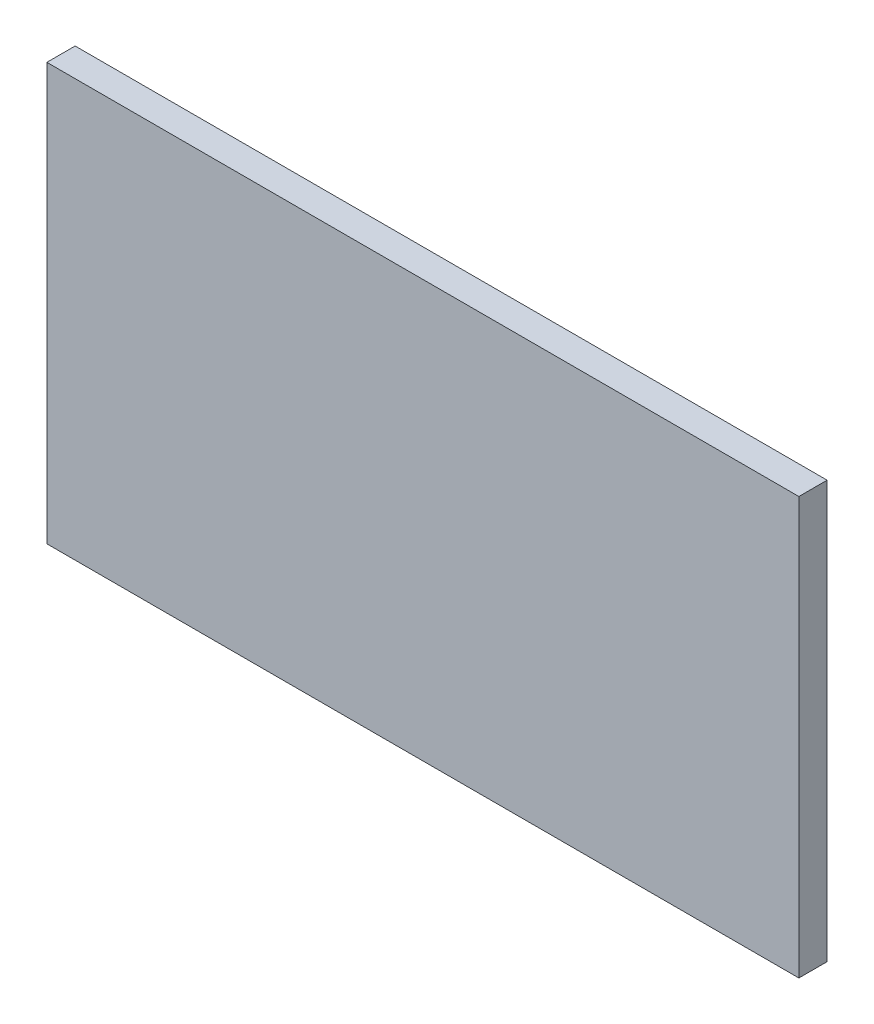
ISO-10303-21;
HEADER;
FILE_DESCRIPTION(('STEP AP214'),'2;1');
FILE_NAME('part.step','',(''),(''),'','','');
FILE_SCHEMA(('AUTOMOTIVE_DESIGN { 1 0 10303 214 1 1 1 1 }'));
ENDSEC;
DATA;
#1=APPLICATION_CONTEXT('core data for automotive mechanical design processes');
#2=APPLICATION_PROTOCOL_DEFINITION('international standard','automotive_design',2000,#1);
#3=PRODUCT_CONTEXT('',#1,'mechanical');
#4=PRODUCT('Part','Part','',(#3));
#5=PRODUCT_RELATED_PRODUCT_CATEGORY('part','',(#4));
#6=PRODUCT_DEFINITION_FORMATION('','',#4);
#7=PRODUCT_DEFINITION_CONTEXT('part definition',#1,'design');
#8=PRODUCT_DEFINITION('design','',#6,#7);
#9=PRODUCT_DEFINITION_SHAPE('','',#8);
#10=(LENGTH_UNIT() NAMED_UNIT(*) SI_UNIT(.MILLI.,.METRE.));
#11=(NAMED_UNIT(*) PLANE_ANGLE_UNIT() SI_UNIT($,.RADIAN.));
#12=(NAMED_UNIT(*) SI_UNIT($,.STERADIAN.) SOLID_ANGLE_UNIT());
#13=UNCERTAINTY_MEASURE_WITH_UNIT(LENGTH_MEASURE(1.E-05),#10,'distance_accuracy_value','');
#14=(GEOMETRIC_REPRESENTATION_CONTEXT(3) GLOBAL_UNCERTAINTY_ASSIGNED_CONTEXT((#13)) GLOBAL_UNIT_ASSIGNED_CONTEXT((#10,
#11,#12)) REPRESENTATION_CONTEXT('',''));
#15=CARTESIAN_POINT('',(0.,0.,0.));
#16=DIRECTION('',(0.,0.,1.));
#17=DIRECTION('',(1.,0.,0.));
#18=AXIS2_PLACEMENT_3D('',#15,#16,#17);
#19=CARTESIAN_POINT('',(13.3,-5.,1.));
#20=DIRECTION('',(1.,0.,0.));
#21=DIRECTION('',(0.,1.,0.));
#22=AXIS2_PLACEMENT_3D('',#19,#20,#21);
#23=PLANE('',#22);
#24=DIRECTION('',(0.,-1.,0.));
#25=VECTOR('',#24,1.);
#26=CARTESIAN_POINT('',(13.3,9.75,1.));
#27=LINE('',#26,#25);
#28=CARTESIAN_POINT('',(13.3,9.75,1.));
#29=VERTEX_POINT('',#28);
#30=CARTESIAN_POINT('',(13.3,-5.,1.));
#31=VERTEX_POINT('',#30);
#32=EDGE_CURVE('E40',#29,#31,#27,.T.);
#33=ORIENTED_EDGE('',*,*,#32,.F.);
#34=DIRECTION('',(0.,0.,1.));
#35=VECTOR('',#34,1.);
#36=CARTESIAN_POINT('',(13.3,9.75,1.));
#37=LINE('',#36,#35);
#38=CARTESIAN_POINT('',(13.3,9.75,2.));
#39=VERTEX_POINT('',#38);
#40=EDGE_CURVE('E11',#29,#39,#37,.T.);
#41=ORIENTED_EDGE('',*,*,#40,.T.);
#42=DIRECTION('',(0.,1.,0.));
#43=VECTOR('',#42,1.);
#44=CARTESIAN_POINT('',(13.3,9.75,2.));
#45=LINE('',#44,#43);
#46=CARTESIAN_POINT('',(13.3,-5.,2.));
#47=VERTEX_POINT('',#46);
#48=EDGE_CURVE('E78',#47,#39,#45,.T.);
#49=ORIENTED_EDGE('',*,*,#48,.F.);
#50=DIRECTION('',(0.,0.,1.));
#51=VECTOR('',#50,1.);
#52=CARTESIAN_POINT('',(13.3,-5.,1.));
#53=LINE('',#52,#51);
#54=EDGE_CURVE('E27',#31,#47,#53,.T.);
#55=ORIENTED_EDGE('',*,*,#54,.F.);
#56=EDGE_LOOP('',(#33,#41,#49,#55));
#57=FACE_BOUND('',#56,.T.);
#58=ADVANCED_FACE('F16',(#57),#23,.T.);
#59=CARTESIAN_POINT('',(-13.3,-5.,1.));
#60=DIRECTION('',(0.,-1.,0.));
#61=DIRECTION('',(0.,0.,-1.));
#62=AXIS2_PLACEMENT_3D('',#59,#60,#61);
#63=PLANE('',#62);
#64=DIRECTION('',(-1.,0.,0.));
#65=VECTOR('',#64,1.);
#66=CARTESIAN_POINT('',(13.3,-5.,1.));
#67=LINE('',#66,#65);
#68=CARTESIAN_POINT('',(-13.3,-5.,1.));
#69=VERTEX_POINT('',#68);
#70=EDGE_CURVE('E20',#31,#69,#67,.T.);
#71=ORIENTED_EDGE('',*,*,#70,.F.);
#72=ORIENTED_EDGE('',*,*,#54,.T.);
#73=DIRECTION('',(1.,0.,0.));
#74=VECTOR('',#73,1.);
#75=CARTESIAN_POINT('',(13.3,-5.,2.));
#76=LINE('',#75,#74);
#77=CARTESIAN_POINT('',(-13.3,-5.,2.));
#78=VERTEX_POINT('',#77);
#79=EDGE_CURVE('E68',#78,#47,#76,.T.);
#80=ORIENTED_EDGE('',*,*,#79,.F.);
#81=DIRECTION('',(0.,0.,1.));
#82=VECTOR('',#81,1.);
#83=CARTESIAN_POINT('',(-13.3,-5.,1.));
#84=LINE('',#83,#82);
#85=EDGE_CURVE('E87',#69,#78,#84,.T.);
#86=ORIENTED_EDGE('',*,*,#85,.F.);
#87=EDGE_LOOP('',(#71,#72,#80,#86));
#88=FACE_BOUND('',#87,.T.);
#89=ADVANCED_FACE('F85',(#88),#63,.T.);
#90=CARTESIAN_POINT('',(-13.3,9.75,1.));
#91=DIRECTION('',(-1.,0.,0.));
#92=DIRECTION('',(0.,0.,1.));
#93=AXIS2_PLACEMENT_3D('',#90,#91,#92);
#94=PLANE('',#93);
#95=DIRECTION('',(0.,1.,0.));
#96=VECTOR('',#95,1.);
#97=CARTESIAN_POINT('',(-13.3,-5.,1.));
#98=LINE('',#97,#96);
#99=CARTESIAN_POINT('',(-13.3,9.75,1.));
#100=VERTEX_POINT('',#99);
#101=EDGE_CURVE('E108',#69,#100,#98,.T.);
#102=ORIENTED_EDGE('',*,*,#101,.F.);
#103=ORIENTED_EDGE('',*,*,#85,.T.);
#104=DIRECTION('',(0.,-1.,0.));
#105=VECTOR('',#104,1.);
#106=CARTESIAN_POINT('',(-13.3,-5.,2.));
#107=LINE('',#106,#105);
#108=CARTESIAN_POINT('',(-13.3,9.75,2.));
#109=VERTEX_POINT('',#108);
#110=EDGE_CURVE('E91',#109,#78,#107,.T.);
#111=ORIENTED_EDGE('',*,*,#110,.F.);
#112=DIRECTION('',(0.,0.,1.));
#113=VECTOR('',#112,1.);
#114=CARTESIAN_POINT('',(-13.3,9.75,1.));
#115=LINE('',#114,#113);
#116=EDGE_CURVE('E104',#100,#109,#115,.T.);
#117=ORIENTED_EDGE('',*,*,#116,.F.);
#118=EDGE_LOOP('',(#102,#103,#111,#117));
#119=FACE_BOUND('',#118,.T.);
#120=ADVANCED_FACE('F18',(#119),#94,.T.);
#121=CARTESIAN_POINT('',(13.3,9.75,1.));
#122=DIRECTION('',(0.,1.,0.));
#123=DIRECTION('',(1.,0.,0.));
#124=AXIS2_PLACEMENT_3D('',#121,#122,#123);
#125=PLANE('',#124);
#126=DIRECTION('',(1.,0.,0.));
#127=VECTOR('',#126,1.);
#128=CARTESIAN_POINT('',(-13.3,9.75,1.));
#129=LINE('',#128,#127);
#130=EDGE_CURVE('E83',#100,#29,#129,.T.);
#131=ORIENTED_EDGE('',*,*,#130,.F.);
#132=ORIENTED_EDGE('',*,*,#116,.T.);
#133=DIRECTION('',(-1.,0.,0.));
#134=VECTOR('',#133,1.);
#135=CARTESIAN_POINT('',(-13.3,9.75,2.));
#136=LINE('',#135,#134);
#137=EDGE_CURVE('E98',#39,#109,#136,.T.);
#138=ORIENTED_EDGE('',*,*,#137,.F.);
#139=ORIENTED_EDGE('',*,*,#40,.F.);
#140=EDGE_LOOP('',(#131,#132,#138,#139));
#141=FACE_BOUND('',#140,.T.);
#142=ADVANCED_FACE('F154',(#141),#125,.T.);
#143=CARTESIAN_POINT('',(0.,2.375,2.));
#144=DIRECTION('',(0.,0.,1.));
#145=DIRECTION('',(1.,0.,0.));
#146=AXIS2_PLACEMENT_3D('',#143,#144,#145);
#147=PLANE('',#146);
#148=ORIENTED_EDGE('',*,*,#137,.T.);
#149=ORIENTED_EDGE('',*,*,#110,.T.);
#150=ORIENTED_EDGE('',*,*,#79,.T.);
#151=ORIENTED_EDGE('',*,*,#48,.T.);
#152=EDGE_LOOP('',(#148,#149,#150,#151));
#153=FACE_BOUND('',#152,.T.);
#154=ADVANCED_FACE('F90',(#153),#147,.T.);
#155=CARTESIAN_POINT('',(0.,2.375,1.));
#156=DIRECTION('',(0.,0.,1.));
#157=DIRECTION('',(1.,0.,0.));
#158=AXIS2_PLACEMENT_3D('',#155,#156,#157);
#159=PLANE('',#158);
#160=ORIENTED_EDGE('',*,*,#130,.T.);
#161=ORIENTED_EDGE('',*,*,#32,.T.);
#162=ORIENTED_EDGE('',*,*,#70,.T.);
#163=ORIENTED_EDGE('',*,*,#101,.T.);
#164=EDGE_LOOP('',(#160,#161,#162,#163));
#165=FACE_BOUND('',#164,.T.);
#166=ADVANCED_FACE('F171',(#165),#159,.F.);
#167=CLOSED_SHELL('',(#58,#89,#120,#142,#154,#166));
#168=MANIFOLD_SOLID_BREP('B1',#167);
#169=ADVANCED_BREP_SHAPE_REPRESENTATION('',(#18,#168),#14);
#170=SHAPE_DEFINITION_REPRESENTATION(#9,#169);
ENDSEC;
END-ISO-10303-21;
